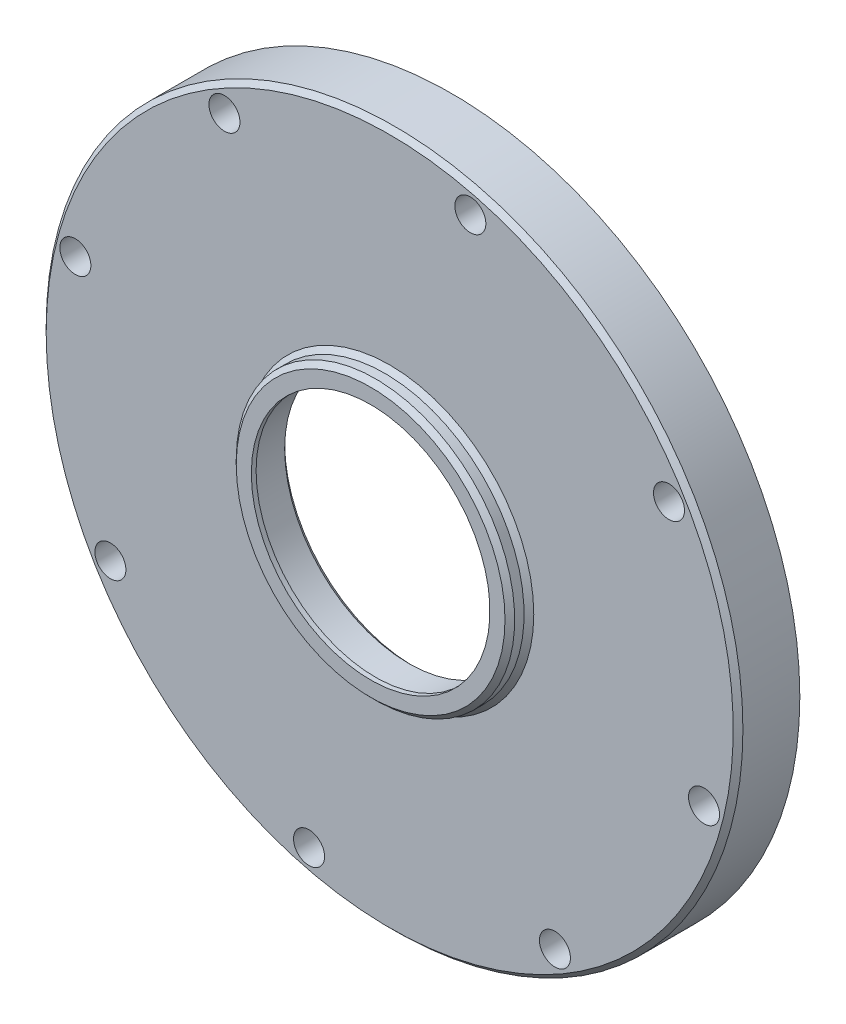
ISO-10303-21;
HEADER;
FILE_DESCRIPTION(('STEP AP214'),'2;1');
FILE_NAME('part.step','',(''),(''),'','','');
FILE_SCHEMA(('AUTOMOTIVE_DESIGN { 1 0 10303 214 1 1 1 1 }'));
ENDSEC;
DATA;
#1=APPLICATION_CONTEXT('core data for automotive mechanical design processes');
#2=APPLICATION_PROTOCOL_DEFINITION('international standard','automotive_design',2000,#1);
#3=PRODUCT_CONTEXT('',#1,'mechanical');
#4=PRODUCT('Part','Part','',(#3));
#5=PRODUCT_RELATED_PRODUCT_CATEGORY('part','',(#4));
#6=PRODUCT_DEFINITION_FORMATION('','',#4);
#7=PRODUCT_DEFINITION_CONTEXT('part definition',#1,'design');
#8=PRODUCT_DEFINITION('design','',#6,#7);
#9=PRODUCT_DEFINITION_SHAPE('','',#8);
#10=(LENGTH_UNIT() NAMED_UNIT(*) SI_UNIT(.MILLI.,.METRE.));
#11=(NAMED_UNIT(*) PLANE_ANGLE_UNIT() SI_UNIT($,.RADIAN.));
#12=(NAMED_UNIT(*) SI_UNIT($,.STERADIAN.) SOLID_ANGLE_UNIT());
#13=UNCERTAINTY_MEASURE_WITH_UNIT(LENGTH_MEASURE(1.E-05),#10,'distance_accuracy_value','');
#14=(GEOMETRIC_REPRESENTATION_CONTEXT(3) GLOBAL_UNCERTAINTY_ASSIGNED_CONTEXT((#13)) GLOBAL_UNIT_ASSIGNED_CONTEXT((#10,
#11,#12)) REPRESENTATION_CONTEXT('',''));
#15=CARTESIAN_POINT('',(0.,0.,0.));
#16=DIRECTION('',(0.,0.,1.));
#17=DIRECTION('',(1.,0.,0.));
#18=AXIS2_PLACEMENT_3D('',#15,#16,#17);
#19=CARTESIAN_POINT('',(0.,-30.191,4.14207745279348));
#20=DIRECTION('',(0.,0.,-1.));
#21=DIRECTION('',(-1.,0.,0.));
#22=AXIS2_PLACEMENT_3D('',#19,#20,#21);
#23=PLANE('',#22);
#24=CARTESIAN_POINT('',(34.6250439964805,-58.5244079700239,4.14207745279348));
#25=DIRECTION('',(0.,0.,-1.));
#26=DIRECTION('',(-1.,0.,0.));
#27=AXIS2_PLACEMENT_3D('',#24,#25,#26);
#28=CIRCLE('',#27,3.25);
#29=CARTESIAN_POINT('',(31.3750439964805,-58.5244079700239,4.14207745279348));
#30=VERTEX_POINT('',#29);
#31=EDGE_CURVE('E128',#30,#30,#28,.F.);
#32=ORIENTED_EDGE('',*,*,#31,.F.);
#33=EDGE_LOOP('',(#32));
#34=FACE_BOUND('',#33,.T.);
#35=CARTESIAN_POINT('',(58.5244079700237,34.6250439964807,4.14207745279348));
#36=DIRECTION('',(0.,0.,-1.));
#37=DIRECTION('',(-1.,0.,0.));
#38=AXIS2_PLACEMENT_3D('',#35,#36,#37);
#39=CIRCLE('',#38,3.25);
#40=CARTESIAN_POINT('',(55.2744079700237,34.6250439964807,4.14207745279348));
#41=VERTEX_POINT('',#40);
#42=EDGE_CURVE('E116',#41,#41,#39,.F.);
#43=ORIENTED_EDGE('',*,*,#42,.F.);
#44=EDGE_LOOP('',(#43));
#45=FACE_BOUND('',#44,.T.);
#46=CARTESIAN_POINT('',(-34.6250439964809,58.5244079700236,4.14207745279348));
#47=DIRECTION('',(0.,0.,-1.));
#48=DIRECTION('',(-1.,0.,0.));
#49=AXIS2_PLACEMENT_3D('',#46,#47,#48);
#50=CIRCLE('',#49,3.25);
#51=CARTESIAN_POINT('',(-37.8750439964809,58.5244079700236,4.14207745279348));
#52=VERTEX_POINT('',#51);
#53=EDGE_CURVE('E104',#52,#52,#50,.F.);
#54=ORIENTED_EDGE('',*,*,#53,.F.);
#55=EDGE_LOOP('',(#54));
#56=FACE_BOUND('',#55,.T.);
#57=CARTESIAN_POINT('',(-58.5244079700235,-34.6250439964811,4.14207745279348));
#58=DIRECTION('',(0.,0.,-1.));
#59=DIRECTION('',(-1.,0.,0.));
#60=AXIS2_PLACEMENT_3D('',#57,#58,#59);
#61=CIRCLE('',#60,3.25);
#62=CARTESIAN_POINT('',(-61.7744079700235,-34.6250439964811,4.14207745279348));
#63=VERTEX_POINT('',#62);
#64=EDGE_CURVE('E92',#63,#63,#61,.F.);
#65=ORIENTED_EDGE('',*,*,#64,.F.);
#66=EDGE_LOOP('',(#65));
#67=FACE_BOUND('',#66,.T.);
#68=CARTESIAN_POINT('',(0.,0.,4.14207745279347));
#69=DIRECTION('',(0.,0.,-1.));
#70=DIRECTION('',(-1.,0.,0.));
#71=AXIS2_PLACEMENT_3D('',#68,#69,#70);
#72=CIRCLE('',#71,71.984);
#73=CARTESIAN_POINT('',(-71.984,0.,4.14207745279347));
#74=VERTEX_POINT('',#73);
#75=EDGE_CURVE('E65',#74,#74,#72,.T.);
#76=ORIENTED_EDGE('',*,*,#75,.F.);
#77=EDGE_LOOP('',(#76));
#78=FACE_BOUND('',#77,.T.);
#79=CARTESIAN_POINT('',(0.,0.,4.14207745279348));
#80=DIRECTION('',(0.,0.,-1.));
#81=DIRECTION('',(-1.,0.,0.));
#82=AXIS2_PLACEMENT_3D('',#79,#80,#81);
#83=CIRCLE('',#82,30.191);
#84=CARTESIAN_POINT('',(-30.191,0.,4.14207745279348));
#85=VERTEX_POINT('',#84);
#86=EDGE_CURVE('E62',#85,#85,#83,.T.);
#87=ORIENTED_EDGE('',*,*,#86,.T.);
#88=EDGE_LOOP('',(#87));
#89=FACE_BOUND('',#88,.T.);
#90=CARTESIAN_POINT('',(-65.866609149326,16.8994023317375,4.14207745279348));
#91=DIRECTION('',(0.,0.,-1.));
#92=DIRECTION('',(-1.,0.,0.));
#93=AXIS2_PLACEMENT_3D('',#90,#91,#92);
#94=CIRCLE('',#93,3.25);
#95=CARTESIAN_POINT('',(-69.116609149326,16.8994023317375,4.14207745279348));
#96=VERTEX_POINT('',#95);
#97=EDGE_CURVE('E98',#96,#96,#94,.F.);
#98=ORIENTED_EDGE('',*,*,#97,.F.);
#99=EDGE_LOOP('',(#98));
#100=FACE_BOUND('',#99,.T.);
#101=CARTESIAN_POINT('',(16.8994023317377,65.8666091493259,4.14207745279348));
#102=DIRECTION('',(0.,0.,-1.));
#103=DIRECTION('',(-1.,0.,0.));
#104=AXIS2_PLACEMENT_3D('',#101,#102,#103);
#105=CIRCLE('',#104,3.24999999999999);
#106=CARTESIAN_POINT('',(13.6494023317377,65.8666091493259,4.14207745279348));
#107=VERTEX_POINT('',#106);
#108=EDGE_CURVE('E110',#107,#107,#105,.F.);
#109=ORIENTED_EDGE('',*,*,#108,.F.);
#110=EDGE_LOOP('',(#109));
#111=FACE_BOUND('',#110,.T.);
#112=CARTESIAN_POINT('',(65.8666091493258,-16.8994023317379,4.14207745279348));
#113=DIRECTION('',(0.,0.,-1.));
#114=DIRECTION('',(-1.,0.,0.));
#115=AXIS2_PLACEMENT_3D('',#112,#113,#114);
#116=CIRCLE('',#115,3.24999999999999);
#117=CARTESIAN_POINT('',(62.6166091493258,-16.8994023317379,4.14207745279348));
#118=VERTEX_POINT('',#117);
#119=EDGE_CURVE('E122',#118,#118,#116,.F.);
#120=ORIENTED_EDGE('',*,*,#119,.F.);
#121=EDGE_LOOP('',(#120));
#122=FACE_BOUND('',#121,.T.);
#123=CARTESIAN_POINT('',(-16.8994023317381,-65.8666091493258,4.14207745279348));
#124=DIRECTION('',(0.,0.,-1.));
#125=DIRECTION('',(-1.,0.,0.));
#126=AXIS2_PLACEMENT_3D('',#123,#124,#125);
#127=CIRCLE('',#126,3.25);
#128=CARTESIAN_POINT('',(-20.1494023317381,-65.8666091493258,4.14207745279348));
#129=VERTEX_POINT('',#128);
#130=EDGE_CURVE('E134',#129,#129,#127,.F.);
#131=ORIENTED_EDGE('',*,*,#130,.F.);
#132=EDGE_LOOP('',(#131));
#133=FACE_BOUND('',#132,.T.);
#134=ADVANCED_FACE('F30',(#34,#45,#56,#67,#78,#89,#100,#111,#122,#133),#23,.F.);
#135=CARTESIAN_POINT('',(0.,-62.5,-8.79922254720652));
#136=DIRECTION('',(0.,0.,1.));
#137=DIRECTION('',(1.,0.,0.));
#138=AXIS2_PLACEMENT_3D('',#135,#136,#137);
#139=PLANE('',#138);
#140=CARTESIAN_POINT('',(34.6250439964805,-58.5244079700239,-8.79922254720652));
#141=DIRECTION('',(0.,0.,1.));
#142=DIRECTION('',(1.,0.,0.));
#143=AXIS2_PLACEMENT_3D('',#140,#141,#142);
#144=CIRCLE('',#143,3.25);
#145=CARTESIAN_POINT('',(37.8750439964805,-58.5244079700239,-8.79922254720652));
#146=VERTEX_POINT('',#145);
#147=EDGE_CURVE('E131',#146,#146,#144,.T.);
#148=ORIENTED_EDGE('',*,*,#147,.T.);
#149=EDGE_LOOP('',(#148));
#150=FACE_BOUND('',#149,.T.);
#151=CARTESIAN_POINT('',(58.5244079700237,34.6250439964807,-8.79922254720652));
#152=DIRECTION('',(0.,0.,1.));
#153=DIRECTION('',(1.,0.,0.));
#154=AXIS2_PLACEMENT_3D('',#151,#152,#153);
#155=CIRCLE('',#154,3.25);
#156=CARTESIAN_POINT('',(61.7744079700237,34.6250439964807,-8.79922254720652));
#157=VERTEX_POINT('',#156);
#158=EDGE_CURVE('E119',#157,#157,#155,.T.);
#159=ORIENTED_EDGE('',*,*,#158,.T.);
#160=EDGE_LOOP('',(#159));
#161=FACE_BOUND('',#160,.T.);
#162=CARTESIAN_POINT('',(-34.6250439964809,58.5244079700236,-8.79922254720652));
#163=DIRECTION('',(0.,0.,1.));
#164=DIRECTION('',(1.,0.,0.));
#165=AXIS2_PLACEMENT_3D('',#162,#163,#164);
#166=CIRCLE('',#165,3.25);
#167=CARTESIAN_POINT('',(-31.3750439964809,58.5244079700236,-8.79922254720652));
#168=VERTEX_POINT('',#167);
#169=EDGE_CURVE('E107',#168,#168,#166,.T.);
#170=ORIENTED_EDGE('',*,*,#169,.T.);
#171=EDGE_LOOP('',(#170));
#172=FACE_BOUND('',#171,.T.);
#173=CARTESIAN_POINT('',(-58.5244079700235,-34.6250439964811,-8.79922254720652));
#174=DIRECTION('',(0.,0.,1.));
#175=DIRECTION('',(1.,0.,0.));
#176=AXIS2_PLACEMENT_3D('',#173,#174,#175);
#177=CIRCLE('',#176,3.25);
#178=CARTESIAN_POINT('',(-55.2744079700235,-34.6250439964811,-8.79922254720652));
#179=VERTEX_POINT('',#178);
#180=EDGE_CURVE('E95',#179,#179,#177,.T.);
#181=ORIENTED_EDGE('',*,*,#180,.T.);
#182=EDGE_LOOP('',(#181));
#183=FACE_BOUND('',#182,.T.);
#184=CARTESIAN_POINT('',(0.,0.,-8.79922254720652));
#185=DIRECTION('',(0.,0.,-1.));
#186=DIRECTION('',(-1.,0.,0.));
#187=AXIS2_PLACEMENT_3D('',#184,#185,#186);
#188=CIRCLE('',#187,62.5);
#189=CARTESIAN_POINT('',(-62.5,0.,-8.79922254720652));
#190=VERTEX_POINT('',#189);
#191=EDGE_CURVE('E74',#190,#190,#188,.T.);
#192=ORIENTED_EDGE('',*,*,#191,.F.);
#193=EDGE_LOOP('',(#192));
#194=FACE_BOUND('',#193,.T.);
#195=CARTESIAN_POINT('',(0.,0.,-8.79922254720652));
#196=DIRECTION('',(0.,0.,-1.));
#197=DIRECTION('',(-1.,0.,0.));
#198=AXIS2_PLACEMENT_3D('',#195,#196,#197);
#199=CIRCLE('',#198,73.);
#200=CARTESIAN_POINT('',(-73.,0.,-8.79922254720652));
#201=VERTEX_POINT('',#200);
#202=EDGE_CURVE('E71',#201,#201,#199,.T.);
#203=ORIENTED_EDGE('',*,*,#202,.T.);
#204=EDGE_LOOP('',(#203));
#205=FACE_BOUND('',#204,.T.);
#206=CARTESIAN_POINT('',(-65.866609149326,16.8994023317375,-8.79922254720652));
#207=DIRECTION('',(0.,0.,1.));
#208=DIRECTION('',(1.,0.,0.));
#209=AXIS2_PLACEMENT_3D('',#206,#207,#208);
#210=CIRCLE('',#209,3.25);
#211=CARTESIAN_POINT('',(-62.6166091493259,16.8994023317375,-8.79922254720652));
#212=VERTEX_POINT('',#211);
#213=EDGE_CURVE('E101',#212,#212,#210,.T.);
#214=ORIENTED_EDGE('',*,*,#213,.T.);
#215=EDGE_LOOP('',(#214));
#216=FACE_BOUND('',#215,.T.);
#217=CARTESIAN_POINT('',(16.8994023317377,65.8666091493259,-8.79922254720652));
#218=DIRECTION('',(0.,0.,1.));
#219=DIRECTION('',(1.,0.,0.));
#220=AXIS2_PLACEMENT_3D('',#217,#218,#219);
#221=CIRCLE('',#220,3.24999999999999);
#222=CARTESIAN_POINT('',(20.1494023317377,65.8666091493259,-8.79922254720652));
#223=VERTEX_POINT('',#222);
#224=EDGE_CURVE('E113',#223,#223,#221,.T.);
#225=ORIENTED_EDGE('',*,*,#224,.T.);
#226=EDGE_LOOP('',(#225));
#227=FACE_BOUND('',#226,.T.);
#228=CARTESIAN_POINT('',(65.8666091493258,-16.8994023317379,-8.79922254720652));
#229=DIRECTION('',(0.,0.,1.));
#230=DIRECTION('',(1.,0.,0.));
#231=AXIS2_PLACEMENT_3D('',#228,#229,#230);
#232=CIRCLE('',#231,3.24999999999999);
#233=CARTESIAN_POINT('',(69.1166091493258,-16.8994023317379,-8.79922254720652));
#234=VERTEX_POINT('',#233);
#235=EDGE_CURVE('E125',#234,#234,#232,.T.);
#236=ORIENTED_EDGE('',*,*,#235,.T.);
#237=EDGE_LOOP('',(#236));
#238=FACE_BOUND('',#237,.T.);
#239=CARTESIAN_POINT('',(-16.8994023317381,-65.8666091493258,-8.79922254720652));
#240=DIRECTION('',(0.,0.,1.));
#241=DIRECTION('',(1.,0.,0.));
#242=AXIS2_PLACEMENT_3D('',#239,#240,#241);
#243=CIRCLE('',#242,3.25);
#244=CARTESIAN_POINT('',(-13.6494023317381,-65.8666091493258,-8.79922254720652));
#245=VERTEX_POINT('',#244);
#246=EDGE_CURVE('E137',#245,#245,#243,.T.);
#247=ORIENTED_EDGE('',*,*,#246,.T.);
#248=EDGE_LOOP('',(#247));
#249=FACE_BOUND('',#248,.T.);
#250=ADVANCED_FACE('F141',(#150,#161,#172,#183,#194,#205,#216,#227,#238,#249),#139,.F.);
#251=CARTESIAN_POINT('',(0.,-29.175,-0.861722547206512));
#252=DIRECTION('',(0.,0.,1.));
#253=DIRECTION('',(1.,0.,0.));
#254=AXIS2_PLACEMENT_3D('',#251,#252,#253);
#255=PLANE('',#254);
#256=CARTESIAN_POINT('',(0.,0.,-0.861722547206512));
#257=DIRECTION('',(0.,0.,-1.));
#258=DIRECTION('',(-1.,0.,0.));
#259=AXIS2_PLACEMENT_3D('',#256,#257,#258);
#260=CIRCLE('',#259,27.016);
#261=CARTESIAN_POINT('',(-27.016,0.,-0.861722547206512));
#262=VERTEX_POINT('',#261);
#263=EDGE_CURVE('E10',#262,#262,#260,.T.);
#264=ORIENTED_EDGE('',*,*,#263,.F.);
#265=EDGE_LOOP('',(#264));
#266=FACE_BOUND('',#265,.T.);
#267=CARTESIAN_POINT('',(0.,0.,-0.861722547206512));
#268=DIRECTION('',(0.,0.,-1.));
#269=DIRECTION('',(-1.,0.,0.));
#270=AXIS2_PLACEMENT_3D('',#267,#268,#269);
#271=CIRCLE('',#270,29.175);
#272=CARTESIAN_POINT('',(-29.175,0.,-0.861722547206512));
#273=VERTEX_POINT('',#272);
#274=EDGE_CURVE('E89',#273,#273,#271,.T.);
#275=ORIENTED_EDGE('',*,*,#274,.T.);
#276=EDGE_LOOP('',(#275));
#277=FACE_BOUND('',#276,.T.);
#278=ADVANCED_FACE('F32',(#266,#277),#255,.F.);
#279=CARTESIAN_POINT('',(0.,0.,-0.861722547206512));
#280=DIRECTION('',(0.,0.,-1.));
#281=DIRECTION('',(-1.,0.,0.));
#282=AXIS2_PLACEMENT_3D('',#279,#280,#281);
#283=CONICAL_SURFACE('',#282,27.016,0.785398163397448);
#284=CARTESIAN_POINT('',(0.,0.,0.154277452793488));
#285=DIRECTION('',(0.,0.,-1.));
#286=DIRECTION('',(-1.,0.,0.));
#287=AXIS2_PLACEMENT_3D('',#284,#285,#286);
#288=CIRCLE('',#287,26.);
#289=CARTESIAN_POINT('',(-26.,0.,0.154277452793488));
#290=VERTEX_POINT('',#289);
#291=EDGE_CURVE('E37',#290,#290,#288,.T.);
#292=ORIENTED_EDGE('',*,*,#291,.F.);
#293=EDGE_LOOP('',(#292));
#294=FACE_BOUND('',#293,.T.);
#295=ORIENTED_EDGE('',*,*,#263,.T.);
#296=EDGE_LOOP('',(#295));
#297=FACE_BOUND('',#296,.T.);
#298=ADVANCED_FACE('F190',(#294,#297),#283,.F.);
#299=CARTESIAN_POINT('',(0.,0.,0.));
#300=DIRECTION('',(0.,0.,-1.));
#301=DIRECTION('',(-1.,0.,0.));
#302=AXIS2_PLACEMENT_3D('',#299,#300,#301);
#303=CYLINDRICAL_SURFACE('',#302,26.);
#304=CARTESIAN_POINT('',(0.,0.,7.13827745279349));
#305=DIRECTION('',(0.,0.,-1.));
#306=DIRECTION('',(-1.,0.,0.));
#307=AXIS2_PLACEMENT_3D('',#304,#305,#306);
#308=CIRCLE('',#307,26.);
#309=CARTESIAN_POINT('',(-26.,0.,7.13827745279349));
#310=VERTEX_POINT('',#309);
#311=EDGE_CURVE('E41',#310,#310,#308,.T.);
#312=ORIENTED_EDGE('',*,*,#311,.F.);
#313=EDGE_LOOP('',(#312));
#314=FACE_BOUND('',#313,.T.);
#315=ORIENTED_EDGE('',*,*,#291,.T.);
#316=EDGE_LOOP('',(#315));
#317=FACE_BOUND('',#316,.T.);
#318=ADVANCED_FACE('F187',(#314,#317),#303,.F.);
#319=CARTESIAN_POINT('',(0.,-26.,7.13827745279349));
#320=DIRECTION('',(0.,0.,1.));
#321=DIRECTION('',(1.,0.,0.));
#322=AXIS2_PLACEMENT_3D('',#319,#320,#321);
#323=PLANE('',#322);
#324=CARTESIAN_POINT('',(0.,0.,7.13827745279349));
#325=DIRECTION('',(0.,0.,-1.));
#326=DIRECTION('',(-1.,0.,0.));
#327=AXIS2_PLACEMENT_3D('',#324,#325,#326);
#328=CIRCLE('',#327,25.);
#329=CARTESIAN_POINT('',(-25.,0.,7.13827745279349));
#330=VERTEX_POINT('',#329);
#331=EDGE_CURVE('E45',#330,#330,#328,.T.);
#332=ORIENTED_EDGE('',*,*,#331,.F.);
#333=EDGE_LOOP('',(#332));
#334=FACE_BOUND('',#333,.T.);
#335=ORIENTED_EDGE('',*,*,#311,.T.);
#336=EDGE_LOOP('',(#335));
#337=FACE_BOUND('',#336,.T.);
#338=ADVANCED_FACE('F183',(#334,#337),#323,.F.);
#339=CARTESIAN_POINT('',(0.,0.,0.));
#340=DIRECTION('',(0.,0.,-1.));
#341=DIRECTION('',(-1.,0.,0.));
#342=AXIS2_PLACEMENT_3D('',#339,#340,#341);
#343=CYLINDRICAL_SURFACE('',#342,25.);
#344=CARTESIAN_POINT('',(0.,0.,8.13827745279349));
#345=DIRECTION('',(0.,0.,-1.));
#346=DIRECTION('',(-1.,0.,0.));
#347=AXIS2_PLACEMENT_3D('',#344,#345,#346);
#348=CIRCLE('',#347,25.);
#349=CARTESIAN_POINT('',(-25.,0.,8.13827745279349));
#350=VERTEX_POINT('',#349);
#351=EDGE_CURVE('E50',#350,#350,#348,.T.);
#352=ORIENTED_EDGE('',*,*,#351,.F.);
#353=EDGE_LOOP('',(#352));
#354=FACE_BOUND('',#353,.T.);
#355=ORIENTED_EDGE('',*,*,#331,.T.);
#356=EDGE_LOOP('',(#355));
#357=FACE_BOUND('',#356,.T.);
#358=ADVANCED_FACE('F179',(#354,#357),#343,.F.);
#359=CARTESIAN_POINT('',(0.,-25.,8.13827745279349));
#360=DIRECTION('',(0.,0.,-1.));
#361=DIRECTION('',(-1.,0.,0.));
#362=AXIS2_PLACEMENT_3D('',#359,#360,#361);
#363=PLANE('',#362);
#364=CARTESIAN_POINT('',(0.,0.,8.13827745279349));
#365=DIRECTION('',(0.,0.,-1.));
#366=DIRECTION('',(-1.,0.,0.));
#367=AXIS2_PLACEMENT_3D('',#364,#365,#366);
#368=CIRCLE('',#367,28.159);
#369=CARTESIAN_POINT('',(-28.159,0.,8.13827745279349));
#370=VERTEX_POINT('',#369);
#371=EDGE_CURVE('E53',#370,#370,#368,.T.);
#372=ORIENTED_EDGE('',*,*,#371,.F.);
#373=EDGE_LOOP('',(#372));
#374=FACE_BOUND('',#373,.T.);
#375=ORIENTED_EDGE('',*,*,#351,.T.);
#376=EDGE_LOOP('',(#375));
#377=FACE_BOUND('',#376,.T.);
#378=ADVANCED_FACE('F175',(#374,#377),#363,.F.);
#379=CARTESIAN_POINT('',(0.,0.,8.13827745279349));
#380=DIRECTION('',(0.,0.,-1.));
#381=DIRECTION('',(-1.,0.,0.));
#382=AXIS2_PLACEMENT_3D('',#379,#380,#381);
#383=CONICAL_SURFACE('',#382,28.159,0.785398163397448);
#384=CARTESIAN_POINT('',(0.,0.,7.12227745279349));
#385=DIRECTION('',(0.,0.,-1.));
#386=DIRECTION('',(-1.,0.,0.));
#387=AXIS2_PLACEMENT_3D('',#384,#385,#386);
#388=CIRCLE('',#387,29.175);
#389=CARTESIAN_POINT('',(-29.175,0.,7.12227745279349));
#390=VERTEX_POINT('',#389);
#391=EDGE_CURVE('E56',#390,#390,#388,.T.);
#392=ORIENTED_EDGE('',*,*,#391,.F.);
#393=EDGE_LOOP('',(#392));
#394=FACE_BOUND('',#393,.T.);
#395=ORIENTED_EDGE('',*,*,#371,.T.);
#396=EDGE_LOOP('',(#395));
#397=FACE_BOUND('',#396,.T.);
#398=ADVANCED_FACE('F171',(#394,#397),#383,.T.);
#399=CARTESIAN_POINT('',(0.,0.,0.));
#400=DIRECTION('',(0.,0.,-1.));
#401=DIRECTION('',(-1.,0.,0.));
#402=AXIS2_PLACEMENT_3D('',#399,#400,#401);
#403=CYLINDRICAL_SURFACE('',#402,29.175);
#404=CARTESIAN_POINT('',(0.,0.,5.15807745279348));
#405=DIRECTION('',(0.,0.,-1.));
#406=DIRECTION('',(-1.,0.,0.));
#407=AXIS2_PLACEMENT_3D('',#404,#405,#406);
#408=CIRCLE('',#407,29.175);
#409=CARTESIAN_POINT('',(-29.175,0.,5.15807745279348));
#410=VERTEX_POINT('',#409);
#411=EDGE_CURVE('E59',#410,#410,#408,.T.);
#412=ORIENTED_EDGE('',*,*,#411,.F.);
#413=EDGE_LOOP('',(#412));
#414=FACE_BOUND('',#413,.T.);
#415=ORIENTED_EDGE('',*,*,#391,.T.);
#416=EDGE_LOOP('',(#415));
#417=FACE_BOUND('',#416,.T.);
#418=ADVANCED_FACE('F167',(#414,#417),#403,.T.);
#419=CARTESIAN_POINT('',(0.,0.,5.15807745279348));
#420=DIRECTION('',(0.,0.,-1.));
#421=DIRECTION('',(-1.,0.,0.));
#422=AXIS2_PLACEMENT_3D('',#419,#420,#421);
#423=CONICAL_SURFACE('',#422,29.175,0.785398163397448);
#424=ORIENTED_EDGE('',*,*,#86,.F.);
#425=EDGE_LOOP('',(#424));
#426=FACE_BOUND('',#425,.T.);
#427=ORIENTED_EDGE('',*,*,#411,.T.);
#428=EDGE_LOOP('',(#427));
#429=FACE_BOUND('',#428,.T.);
#430=ADVANCED_FACE('F164',(#426,#429),#423,.T.);
#431=CARTESIAN_POINT('',(0.,0.,4.14207745279347));
#432=DIRECTION('',(0.,0.,-1.));
#433=DIRECTION('',(-1.,0.,0.));
#434=AXIS2_PLACEMENT_3D('',#431,#432,#433);
#435=CONICAL_SURFACE('',#434,71.984,0.78539816339745);
#436=CARTESIAN_POINT('',(0.,0.,3.12607745279348));
#437=DIRECTION('',(0.,0.,-1.));
#438=DIRECTION('',(-1.,0.,0.));
#439=AXIS2_PLACEMENT_3D('',#436,#437,#438);
#440=CIRCLE('',#439,73.);
#441=CARTESIAN_POINT('',(-73.,0.,3.12607745279348));
#442=VERTEX_POINT('',#441);
#443=EDGE_CURVE('E68',#442,#442,#440,.T.);
#444=ORIENTED_EDGE('',*,*,#443,.F.);
#445=EDGE_LOOP('',(#444));
#446=FACE_BOUND('',#445,.T.);
#447=ORIENTED_EDGE('',*,*,#75,.T.);
#448=EDGE_LOOP('',(#447));
#449=FACE_BOUND('',#448,.T.);
#450=ADVANCED_FACE('F162',(#446,#449),#435,.T.);
#451=CARTESIAN_POINT('',(0.,0.,0.));
#452=DIRECTION('',(0.,0.,-1.));
#453=DIRECTION('',(-1.,0.,0.));
#454=AXIS2_PLACEMENT_3D('',#451,#452,#453);
#455=CYLINDRICAL_SURFACE('',#454,73.);
#456=ORIENTED_EDGE('',*,*,#202,.F.);
#457=EDGE_LOOP('',(#456));
#458=FACE_BOUND('',#457,.T.);
#459=ORIENTED_EDGE('',*,*,#443,.T.);
#460=EDGE_LOOP('',(#459));
#461=FACE_BOUND('',#460,.T.);
#462=ADVANCED_FACE('F231',(#458,#461),#455,.T.);
#463=CARTESIAN_POINT('',(0.,0.,0.));
#464=DIRECTION('',(0.,0.,-1.));
#465=DIRECTION('',(-1.,0.,0.));
#466=AXIS2_PLACEMENT_3D('',#463,#464,#465);
#467=CYLINDRICAL_SURFACE('',#466,62.5);
#468=CARTESIAN_POINT('',(0.,0.,-0.048922547206523));
#469=DIRECTION('',(0.,0.,-1.));
#470=DIRECTION('',(-1.,0.,0.));
#471=AXIS2_PLACEMENT_3D('',#468,#469,#470);
#472=CIRCLE('',#471,62.5);
#473=CARTESIAN_POINT('',(-62.5,0.,-0.048922547206523));
#474=VERTEX_POINT('',#473);
#475=EDGE_CURVE('E77',#474,#474,#472,.T.);
#476=ORIENTED_EDGE('',*,*,#475,.F.);
#477=EDGE_LOOP('',(#476));
#478=FACE_BOUND('',#477,.T.);
#479=ORIENTED_EDGE('',*,*,#191,.T.);
#480=EDGE_LOOP('',(#479));
#481=FACE_BOUND('',#480,.T.);
#482=ADVANCED_FACE('F225',(#478,#481),#467,.F.);
#483=CARTESIAN_POINT('',(0.,0.,-0.048922547206523));
#484=DIRECTION('',(0.,0.,-1.));
#485=DIRECTION('',(-1.,0.,0.));
#486=AXIS2_PLACEMENT_3D('',#483,#484,#485);
#487=CONICAL_SURFACE('',#486,62.5,0.78539816339745);
#488=CARTESIAN_POINT('',(0.,0.,0.967077452793477));
#489=DIRECTION('',(0.,0.,-1.));
#490=DIRECTION('',(-1.,0.,0.));
#491=AXIS2_PLACEMENT_3D('',#488,#489,#490);
#492=CIRCLE('',#491,61.484);
#493=CARTESIAN_POINT('',(-61.484,0.,0.967077452793477));
#494=VERTEX_POINT('',#493);
#495=EDGE_CURVE('E80',#494,#494,#492,.T.);
#496=ORIENTED_EDGE('',*,*,#495,.F.);
#497=EDGE_LOOP('',(#496));
#498=FACE_BOUND('',#497,.T.);
#499=ORIENTED_EDGE('',*,*,#475,.T.);
#500=EDGE_LOOP('',(#499));
#501=FACE_BOUND('',#500,.T.);
#502=ADVANCED_FACE('F219',(#498,#501),#487,.F.);
#503=CARTESIAN_POINT('',(0.,-30.191,0.967077452793479));
#504=DIRECTION('',(0.,0.,1.));
#505=DIRECTION('',(1.,0.,0.));
#506=AXIS2_PLACEMENT_3D('',#503,#504,#505);
#507=PLANE('',#506);
#508=CARTESIAN_POINT('',(0.,0.,0.967077452793481));
#509=DIRECTION('',(0.,0.,-1.));
#510=DIRECTION('',(-1.,0.,0.));
#511=AXIS2_PLACEMENT_3D('',#508,#509,#510);
#512=CIRCLE('',#511,30.191);
#513=CARTESIAN_POINT('',(-30.191,0.,0.967077452793481));
#514=VERTEX_POINT('',#513);
#515=EDGE_CURVE('E83',#514,#514,#512,.T.);
#516=ORIENTED_EDGE('',*,*,#515,.F.);
#517=EDGE_LOOP('',(#516));
#518=FACE_BOUND('',#517,.T.);
#519=ORIENTED_EDGE('',*,*,#495,.T.);
#520=EDGE_LOOP('',(#519));
#521=FACE_BOUND('',#520,.T.);
#522=ADVANCED_FACE('F213',(#518,#521),#507,.F.);
#523=CARTESIAN_POINT('',(0.,0.,0.967077452793481));
#524=DIRECTION('',(0.,0.,1.));
#525=DIRECTION('',(1.,0.,0.));
#526=AXIS2_PLACEMENT_3D('',#523,#524,#525);
#527=CONICAL_SURFACE('',#526,30.191,0.785398163397448);
#528=CARTESIAN_POINT('',(0.,0.,-0.0489225472065191));
#529=DIRECTION('',(0.,0.,-1.));
#530=DIRECTION('',(-1.,0.,0.));
#531=AXIS2_PLACEMENT_3D('',#528,#529,#530);
#532=CIRCLE('',#531,29.175);
#533=CARTESIAN_POINT('',(-29.175,0.,-0.0489225472065191));
#534=VERTEX_POINT('',#533);
#535=EDGE_CURVE('E86',#534,#534,#532,.T.);
#536=ORIENTED_EDGE('',*,*,#535,.F.);
#537=EDGE_LOOP('',(#536));
#538=FACE_BOUND('',#537,.T.);
#539=ORIENTED_EDGE('',*,*,#515,.T.);
#540=EDGE_LOOP('',(#539));
#541=FACE_BOUND('',#540,.T.);
#542=ADVANCED_FACE('F207',(#538,#541),#527,.T.);
#543=CARTESIAN_POINT('',(0.,0.,0.));
#544=DIRECTION('',(0.,0.,-1.));
#545=DIRECTION('',(-1.,0.,0.));
#546=AXIS2_PLACEMENT_3D('',#543,#544,#545);
#547=CYLINDRICAL_SURFACE('',#546,29.175);
#548=ORIENTED_EDGE('',*,*,#274,.F.);
#549=EDGE_LOOP('',(#548));
#550=FACE_BOUND('',#549,.T.);
#551=ORIENTED_EDGE('',*,*,#535,.T.);
#552=EDGE_LOOP('',(#551));
#553=FACE_BOUND('',#552,.T.);
#554=ADVANCED_FACE('F203',(#550,#553),#547,.T.);
#555=CARTESIAN_POINT('',(-58.5244079700235,-34.6250439964811,8.13827745279349));
#556=DIRECTION('',(0.,0.,-1.));
#557=DIRECTION('',(-1.,0.,0.));
#558=AXIS2_PLACEMENT_3D('',#555,#556,#557);
#559=CYLINDRICAL_SURFACE('',#558,3.25);
#560=ORIENTED_EDGE('',*,*,#180,.F.);
#561=EDGE_LOOP('',(#560));
#562=FACE_BOUND('',#561,.T.);
#563=ORIENTED_EDGE('',*,*,#64,.T.);
#564=EDGE_LOOP('',(#563));
#565=FACE_BOUND('',#564,.T.);
#566=ADVANCED_FACE('F206',(#562,#565),#559,.F.);
#567=CARTESIAN_POINT('',(-65.866609149326,16.8994023317375,8.13827745279349));
#568=DIRECTION('',(0.,0.,-1.));
#569=DIRECTION('',(-1.,0.,0.));
#570=AXIS2_PLACEMENT_3D('',#567,#568,#569);
#571=CYLINDRICAL_SURFACE('',#570,3.25);
#572=ORIENTED_EDGE('',*,*,#213,.F.);
#573=EDGE_LOOP('',(#572));
#574=FACE_BOUND('',#573,.T.);
#575=ORIENTED_EDGE('',*,*,#97,.T.);
#576=EDGE_LOOP('',(#575));
#577=FACE_BOUND('',#576,.T.);
#578=ADVANCED_FACE('F267',(#574,#577),#571,.F.);
#579=CARTESIAN_POINT('',(-34.6250439964809,58.5244079700236,8.13827745279349));
#580=DIRECTION('',(0.,0.,-1.));
#581=DIRECTION('',(-1.,0.,0.));
#582=AXIS2_PLACEMENT_3D('',#579,#580,#581);
#583=CYLINDRICAL_SURFACE('',#582,3.25);
#584=ORIENTED_EDGE('',*,*,#169,.F.);
#585=EDGE_LOOP('',(#584));
#586=FACE_BOUND('',#585,.T.);
#587=ORIENTED_EDGE('',*,*,#53,.T.);
#588=EDGE_LOOP('',(#587));
#589=FACE_BOUND('',#588,.T.);
#590=ADVANCED_FACE('F263',(#586,#589),#583,.F.);
#591=CARTESIAN_POINT('',(16.8994023317377,65.8666091493259,8.13827745279349));
#592=DIRECTION('',(0.,0.,-1.));
#593=DIRECTION('',(-1.,0.,0.));
#594=AXIS2_PLACEMENT_3D('',#591,#592,#593);
#595=CYLINDRICAL_SURFACE('',#594,3.24999999999999);
#596=ORIENTED_EDGE('',*,*,#224,.F.);
#597=EDGE_LOOP('',(#596));
#598=FACE_BOUND('',#597,.T.);
#599=ORIENTED_EDGE('',*,*,#108,.T.);
#600=EDGE_LOOP('',(#599));
#601=FACE_BOUND('',#600,.T.);
#602=ADVANCED_FACE('F257',(#598,#601),#595,.F.);
#603=CARTESIAN_POINT('',(58.5244079700237,34.6250439964807,8.13827745279349));
#604=DIRECTION('',(0.,0.,-1.));
#605=DIRECTION('',(-1.,0.,0.));
#606=AXIS2_PLACEMENT_3D('',#603,#604,#605);
#607=CYLINDRICAL_SURFACE('',#606,3.25);
#608=ORIENTED_EDGE('',*,*,#158,.F.);
#609=EDGE_LOOP('',(#608));
#610=FACE_BOUND('',#609,.T.);
#611=ORIENTED_EDGE('',*,*,#42,.T.);
#612=EDGE_LOOP('',(#611));
#613=FACE_BOUND('',#612,.T.);
#614=ADVANCED_FACE('F247',(#610,#613),#607,.F.);
#615=CARTESIAN_POINT('',(65.8666091493258,-16.8994023317379,8.13827745279349));
#616=DIRECTION('',(0.,0.,-1.));
#617=DIRECTION('',(-1.,0.,0.));
#618=AXIS2_PLACEMENT_3D('',#615,#616,#617);
#619=CYLINDRICAL_SURFACE('',#618,3.24999999999999);
#620=ORIENTED_EDGE('',*,*,#235,.F.);
#621=EDGE_LOOP('',(#620));
#622=FACE_BOUND('',#621,.T.);
#623=ORIENTED_EDGE('',*,*,#119,.T.);
#624=EDGE_LOOP('',(#623));
#625=FACE_BOUND('',#624,.T.);
#626=ADVANCED_FACE('F244',(#622,#625),#619,.F.);
#627=CARTESIAN_POINT('',(34.6250439964805,-58.5244079700239,8.13827745279349));
#628=DIRECTION('',(0.,0.,-1.));
#629=DIRECTION('',(-1.,0.,0.));
#630=AXIS2_PLACEMENT_3D('',#627,#628,#629);
#631=CYLINDRICAL_SURFACE('',#630,3.25);
#632=ORIENTED_EDGE('',*,*,#147,.F.);
#633=EDGE_LOOP('',(#632));
#634=FACE_BOUND('',#633,.T.);
#635=ORIENTED_EDGE('',*,*,#31,.T.);
#636=EDGE_LOOP('',(#635));
#637=FACE_BOUND('',#636,.T.);
#638=ADVANCED_FACE('F146',(#634,#637),#631,.F.);
#639=CARTESIAN_POINT('',(-16.8994023317381,-65.8666091493258,8.13827745279349));
#640=DIRECTION('',(0.,0.,-1.));
#641=DIRECTION('',(-1.,0.,0.));
#642=AXIS2_PLACEMENT_3D('',#639,#640,#641);
#643=CYLINDRICAL_SURFACE('',#642,3.25);
#644=ORIENTED_EDGE('',*,*,#246,.F.);
#645=EDGE_LOOP('',(#644));
#646=FACE_BOUND('',#645,.T.);
#647=ORIENTED_EDGE('',*,*,#130,.T.);
#648=EDGE_LOOP('',(#647));
#649=FACE_BOUND('',#648,.T.);
#650=ADVANCED_FACE('F143',(#646,#649),#643,.F.);
#651=CLOSED_SHELL('',(#134,#250,#278,#298,#318,#338,#358,#378,#398,#418,#430,#450,#462,#482,
#502,#522,#542,#554,#566,#578,#590,#602,#614,#626,#638,#650));
#652=MANIFOLD_SOLID_BREP('B2',#651);
#653=ADVANCED_BREP_SHAPE_REPRESENTATION('',(#18,#652),#14);
#654=SHAPE_DEFINITION_REPRESENTATION(#9,#653);
ENDSEC;
END-ISO-10303-21;
